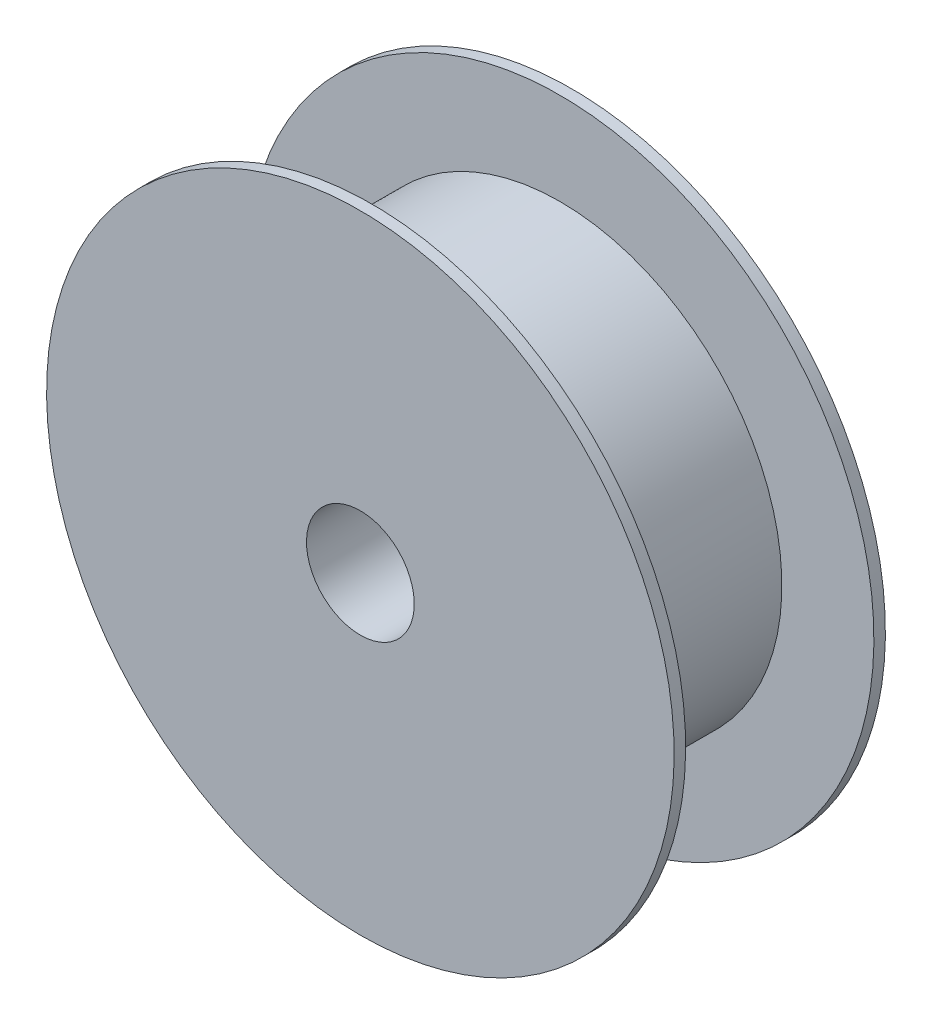
ISO-10303-21;
HEADER;
FILE_DESCRIPTION(('STEP AP214'),'2;1');
FILE_NAME('part.step','',(''),(''),'','','');
FILE_SCHEMA(('AUTOMOTIVE_DESIGN { 1 0 10303 214 1 1 1 1 }'));
ENDSEC;
DATA;
#1=APPLICATION_CONTEXT('core data for automotive mechanical design processes');
#2=APPLICATION_PROTOCOL_DEFINITION('international standard','automotive_design',2000,#1);
#3=PRODUCT_CONTEXT('',#1,'mechanical');
#4=PRODUCT('Part','Part','',(#3));
#5=PRODUCT_RELATED_PRODUCT_CATEGORY('part','',(#4));
#6=PRODUCT_DEFINITION_FORMATION('','',#4);
#7=PRODUCT_DEFINITION_CONTEXT('part definition',#1,'design');
#8=PRODUCT_DEFINITION('design','',#6,#7);
#9=PRODUCT_DEFINITION_SHAPE('','',#8);
#10=(LENGTH_UNIT() NAMED_UNIT(*) SI_UNIT(.MILLI.,.METRE.));
#11=(NAMED_UNIT(*) PLANE_ANGLE_UNIT() SI_UNIT($,.RADIAN.));
#12=(NAMED_UNIT(*) SI_UNIT($,.STERADIAN.) SOLID_ANGLE_UNIT());
#13=UNCERTAINTY_MEASURE_WITH_UNIT(LENGTH_MEASURE(1.E-05),#10,'distance_accuracy_value','');
#14=(GEOMETRIC_REPRESENTATION_CONTEXT(3) GLOBAL_UNCERTAINTY_ASSIGNED_CONTEXT((#13)) GLOBAL_UNIT_ASSIGNED_CONTEXT((#10,
#11,#12)) REPRESENTATION_CONTEXT('',''));
#15=CARTESIAN_POINT('',(0.,0.,0.));
#16=DIRECTION('',(0.,0.,1.));
#17=DIRECTION('',(1.,0.,0.));
#18=AXIS2_PLACEMENT_3D('',#15,#16,#17);
#19=CARTESIAN_POINT('',(0.,0.,50.5000000000001));
#20=DIRECTION('',(0.,0.,-1.));
#21=DIRECTION('',(0.,1.,0.));
#22=AXIS2_PLACEMENT_3D('',#19,#20,#21);
#23=PLANE('',#22);
#24=CARTESIAN_POINT('',(0.,0.,50.5));
#25=DIRECTION('',(0.,0.,1.));
#26=DIRECTION('',(0.,-1.,0.));
#27=AXIS2_PLACEMENT_3D('',#24,#25,#26);
#28=CIRCLE('',#27,25.7499999999999);
#29=CARTESIAN_POINT('',(0.,-25.7499999999999,50.5));
#30=VERTEX_POINT('',#29);
#31=EDGE_CURVE('E10',#30,#30,#28,.T.);
#32=ORIENTED_EDGE('',*,*,#31,.F.);
#33=EDGE_LOOP('',(#32));
#34=FACE_BOUND('',#33,.T.);
#35=CARTESIAN_POINT('',(0.,0.,50.5000000000001));
#36=DIRECTION('',(0.,0.,1.));
#37=DIRECTION('',(0.,-1.,0.));
#38=AXIS2_PLACEMENT_3D('',#35,#36,#37);
#39=CIRCLE('',#38,150.);
#40=CARTESIAN_POINT('',(0.,-150.,50.5000000000001));
#41=VERTEX_POINT('',#40);
#42=EDGE_CURVE('E69',#41,#41,#39,.T.);
#43=ORIENTED_EDGE('',*,*,#42,.T.);
#44=EDGE_LOOP('',(#43));
#45=FACE_BOUND('',#44,.T.);
#46=ADVANCED_FACE('F37',(#34,#45),#23,.F.);
#47=CARTESIAN_POINT('',(0.,0.,50.5));
#48=DIRECTION('',(0.,0.,1.));
#49=DIRECTION('',(0.,-1.,0.));
#50=AXIS2_PLACEMENT_3D('',#47,#48,#49);
#51=CYLINDRICAL_SURFACE('',#50,25.7499999999999);
#52=CARTESIAN_POINT('',(0.,0.,-50.5));
#53=DIRECTION('',(0.,0.,1.));
#54=DIRECTION('',(0.,-1.,0.));
#55=AXIS2_PLACEMENT_3D('',#52,#53,#54);
#56=CIRCLE('',#55,25.7499999999999);
#57=CARTESIAN_POINT('',(0.,-25.7499999999999,-50.5));
#58=VERTEX_POINT('',#57);
#59=EDGE_CURVE('E43',#58,#58,#56,.T.);
#60=ORIENTED_EDGE('',*,*,#59,.F.);
#61=EDGE_LOOP('',(#60));
#62=FACE_BOUND('',#61,.T.);
#63=ORIENTED_EDGE('',*,*,#31,.T.);
#64=EDGE_LOOP('',(#63));
#65=FACE_BOUND('',#64,.T.);
#66=ADVANCED_FACE('F86',(#62,#65),#51,.F.);
#67=CARTESIAN_POINT('',(0.,0.,-50.4999999999999));
#68=DIRECTION('',(0.,0.,-1.));
#69=DIRECTION('',(0.,1.,0.));
#70=AXIS2_PLACEMENT_3D('',#67,#68,#69);
#71=PLANE('',#70);
#72=ORIENTED_EDGE('',*,*,#59,.T.);
#73=EDGE_LOOP('',(#72));
#74=FACE_BOUND('',#73,.T.);
#75=CARTESIAN_POINT('',(0.,0.,-50.4999999999999));
#76=DIRECTION('',(0.,0.,1.));
#77=DIRECTION('',(0.,-1.,0.));
#78=AXIS2_PLACEMENT_3D('',#75,#76,#77);
#79=CIRCLE('',#78,150.);
#80=CARTESIAN_POINT('',(0.,-150.,-50.4999999999999));
#81=VERTEX_POINT('',#80);
#82=EDGE_CURVE('E48',#81,#81,#79,.T.);
#83=ORIENTED_EDGE('',*,*,#82,.F.);
#84=EDGE_LOOP('',(#83));
#85=FACE_BOUND('',#84,.T.);
#86=ADVANCED_FACE('F91',(#74,#85),#71,.T.);
#87=CARTESIAN_POINT('',(0.,0.,50.5));
#88=DIRECTION('',(0.,0.,1.));
#89=DIRECTION('',(0.,-1.,0.));
#90=AXIS2_PLACEMENT_3D('',#87,#88,#89);
#91=CYLINDRICAL_SURFACE('',#90,150.);
#92=ORIENTED_EDGE('',*,*,#82,.T.);
#93=EDGE_LOOP('',(#92));
#94=FACE_BOUND('',#93,.T.);
#95=CARTESIAN_POINT('',(0.,0.,-45.));
#96=DIRECTION('',(0.,0.,1.));
#97=DIRECTION('',(0.,-1.,0.));
#98=AXIS2_PLACEMENT_3D('',#95,#96,#97);
#99=CIRCLE('',#98,150.);
#100=CARTESIAN_POINT('',(0.,-150.,-45.));
#101=VERTEX_POINT('',#100);
#102=EDGE_CURVE('E54',#101,#101,#99,.T.);
#103=ORIENTED_EDGE('',*,*,#102,.F.);
#104=EDGE_LOOP('',(#103));
#105=FACE_BOUND('',#104,.T.);
#106=ADVANCED_FACE('F96',(#94,#105),#91,.T.);
#107=CARTESIAN_POINT('',(0.,0.,-45.));
#108=DIRECTION('',(0.,0.,-1.));
#109=DIRECTION('',(0.,1.,0.));
#110=AXIS2_PLACEMENT_3D('',#107,#108,#109);
#111=PLANE('',#110);
#112=CARTESIAN_POINT('',(0.,0.,-45.));
#113=DIRECTION('',(0.,0.,1.));
#114=DIRECTION('',(0.,-1.,0.));
#115=AXIS2_PLACEMENT_3D('',#112,#113,#114);
#116=CIRCLE('',#115,106.);
#117=CARTESIAN_POINT('',(0.,-106.,-45.));
#118=VERTEX_POINT('',#117);
#119=EDGE_CURVE('E60',#118,#118,#116,.T.);
#120=ORIENTED_EDGE('',*,*,#119,.F.);
#121=EDGE_LOOP('',(#120));
#122=FACE_BOUND('',#121,.T.);
#123=ORIENTED_EDGE('',*,*,#102,.T.);
#124=EDGE_LOOP('',(#123));
#125=FACE_BOUND('',#124,.T.);
#126=ADVANCED_FACE('F101',(#122,#125),#111,.F.);
#127=CARTESIAN_POINT('',(0.,0.,50.5));
#128=DIRECTION('',(0.,0.,1.));
#129=DIRECTION('',(0.,-1.,0.));
#130=AXIS2_PLACEMENT_3D('',#127,#128,#129);
#131=CYLINDRICAL_SURFACE('',#130,106.);
#132=CARTESIAN_POINT('',(0.,0.,45.));
#133=DIRECTION('',(0.,0.,1.));
#134=DIRECTION('',(0.,-1.,0.));
#135=AXIS2_PLACEMENT_3D('',#132,#133,#134);
#136=CIRCLE('',#135,106.);
#137=CARTESIAN_POINT('',(0.,-106.,45.));
#138=VERTEX_POINT('',#137);
#139=EDGE_CURVE('E63',#138,#138,#136,.T.);
#140=ORIENTED_EDGE('',*,*,#139,.F.);
#141=EDGE_LOOP('',(#140));
#142=FACE_BOUND('',#141,.T.);
#143=ORIENTED_EDGE('',*,*,#119,.T.);
#144=EDGE_LOOP('',(#143));
#145=FACE_BOUND('',#144,.T.);
#146=ADVANCED_FACE('F82',(#142,#145),#131,.T.);
#147=CARTESIAN_POINT('',(0.,0.,45.));
#148=DIRECTION('',(0.,0.,-1.));
#149=DIRECTION('',(0.,1.,0.));
#150=AXIS2_PLACEMENT_3D('',#147,#148,#149);
#151=PLANE('',#150);
#152=ORIENTED_EDGE('',*,*,#139,.T.);
#153=EDGE_LOOP('',(#152));
#154=FACE_BOUND('',#153,.T.);
#155=CARTESIAN_POINT('',(0.,0.,45.));
#156=DIRECTION('',(0.,0.,1.));
#157=DIRECTION('',(0.,-1.,0.));
#158=AXIS2_PLACEMENT_3D('',#155,#156,#157);
#159=CIRCLE('',#158,150.);
#160=CARTESIAN_POINT('',(0.,-150.,45.));
#161=VERTEX_POINT('',#160);
#162=EDGE_CURVE('E66',#161,#161,#159,.T.);
#163=ORIENTED_EDGE('',*,*,#162,.F.);
#164=EDGE_LOOP('',(#163));
#165=FACE_BOUND('',#164,.T.);
#166=ADVANCED_FACE('F76',(#154,#165),#151,.T.);
#167=CARTESIAN_POINT('',(0.,0.,50.5));
#168=DIRECTION('',(0.,0.,1.));
#169=DIRECTION('',(0.,-1.,0.));
#170=AXIS2_PLACEMENT_3D('',#167,#168,#169);
#171=CYLINDRICAL_SURFACE('',#170,150.);
#172=ORIENTED_EDGE('',*,*,#162,.T.);
#173=EDGE_LOOP('',(#172));
#174=FACE_BOUND('',#173,.T.);
#175=ORIENTED_EDGE('',*,*,#42,.F.);
#176=EDGE_LOOP('',(#175));
#177=FACE_BOUND('',#176,.T.);
#178=ADVANCED_FACE('F74',(#174,#177),#171,.T.);
#179=CLOSED_SHELL('',(#46,#66,#86,#106,#126,#146,#166,#178));
#180=MANIFOLD_SOLID_BREP('B2',#179);
#181=ADVANCED_BREP_SHAPE_REPRESENTATION('',(#18,#180),#14);
#182=SHAPE_DEFINITION_REPRESENTATION(#9,#181);
ENDSEC;
END-ISO-10303-21;
